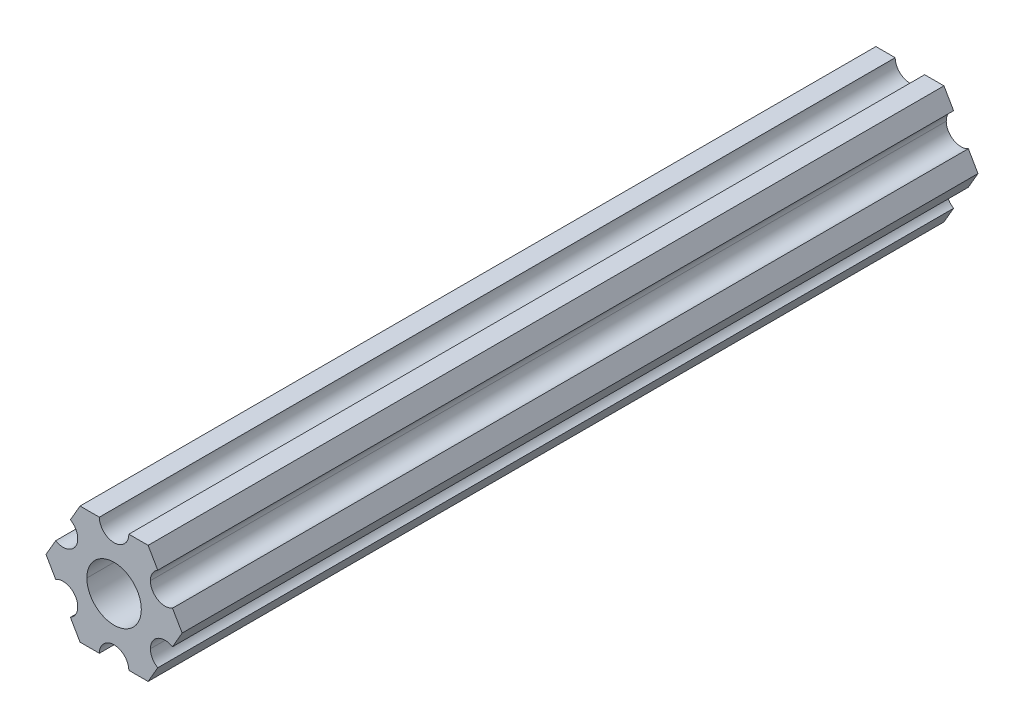
ISO-10303-21;
HEADER;
FILE_DESCRIPTION(('STEP AP214'),'2;1');
FILE_NAME('part.step','',(''),(''),'','','');
FILE_SCHEMA(('AUTOMOTIVE_DESIGN { 1 0 10303 214 1 1 1 1 }'));
ENDSEC;
DATA;
#1=APPLICATION_CONTEXT('core data for automotive mechanical design processes');
#2=APPLICATION_PROTOCOL_DEFINITION('international standard','automotive_design',2000,#1);
#3=PRODUCT_CONTEXT('',#1,'mechanical');
#4=PRODUCT('Part','Part','',(#3));
#5=PRODUCT_RELATED_PRODUCT_CATEGORY('part','',(#4));
#6=PRODUCT_DEFINITION_FORMATION('','',#4);
#7=PRODUCT_DEFINITION_CONTEXT('part definition',#1,'design');
#8=PRODUCT_DEFINITION('design','',#6,#7);
#9=PRODUCT_DEFINITION_SHAPE('','',#8);
#10=(LENGTH_UNIT() NAMED_UNIT(*) SI_UNIT(.MILLI.,.METRE.));
#11=(NAMED_UNIT(*) PLANE_ANGLE_UNIT() SI_UNIT($,.RADIAN.));
#12=(NAMED_UNIT(*) SI_UNIT($,.STERADIAN.) SOLID_ANGLE_UNIT());
#13=UNCERTAINTY_MEASURE_WITH_UNIT(LENGTH_MEASURE(1.E-05),#10,'distance_accuracy_value','');
#14=(GEOMETRIC_REPRESENTATION_CONTEXT(3) GLOBAL_UNCERTAINTY_ASSIGNED_CONTEXT((#13)) GLOBAL_UNIT_ASSIGNED_CONTEXT((#10,
#11,#12)) REPRESENTATION_CONTEXT('',''));
#15=CARTESIAN_POINT('',(0.,0.,0.));
#16=DIRECTION('',(0.,0.,1.));
#17=DIRECTION('',(1.,0.,0.));
#18=AXIS2_PLACEMENT_3D('',#15,#16,#17);
#19=CARTESIAN_POINT('',(0.,0.,85.725));
#20=DIRECTION('',(0.,0.,-1.));
#21=DIRECTION('',(-1.,0.,0.));
#22=AXIS2_PLACEMENT_3D('',#19,#20,#21);
#23=CYLINDRICAL_SURFACE('',#22,2.9337);
#24=DIRECTION('',(0.,0.,-1.));
#25=VECTOR('',#24,1.);
#26=CARTESIAN_POINT('',(2.9337,0.,85.725));
#27=LINE('',#26,#25);
#28=CARTESIAN_POINT('',(2.9337,0.,85.725));
#29=VERTEX_POINT('',#28);
#30=CARTESIAN_POINT('',(2.9337,0.,0.));
#31=VERTEX_POINT('',#30);
#32=EDGE_CURVE('E262',#29,#31,#27,.T.);
#33=ORIENTED_EDGE('',*,*,#32,.F.);
#34=CARTESIAN_POINT('',(0.,0.,85.725));
#35=DIRECTION('',(0.,0.,1.));
#36=DIRECTION('',(1.,0.,0.));
#37=AXIS2_PLACEMENT_3D('',#34,#35,#36);
#38=CIRCLE('',#37,2.9337);
#39=CARTESIAN_POINT('',(-2.9337,0.,85.725));
#40=VERTEX_POINT('',#39);
#41=EDGE_CURVE('E231',#29,#40,#38,.T.);
#42=ORIENTED_EDGE('',*,*,#41,.T.);
#43=DIRECTION('',(0.,0.,-1.));
#44=VECTOR('',#43,1.);
#45=CARTESIAN_POINT('',(-2.9337,0.,85.725));
#46=LINE('',#45,#44);
#47=CARTESIAN_POINT('',(-2.9337,0.,0.));
#48=VERTEX_POINT('',#47);
#49=EDGE_CURVE('E270',#40,#48,#46,.T.);
#50=ORIENTED_EDGE('',*,*,#49,.T.);
#51=CARTESIAN_POINT('',(0.,0.,0.));
#52=DIRECTION('',(0.,0.,1.));
#53=DIRECTION('',(1.,0.,0.));
#54=AXIS2_PLACEMENT_3D('',#51,#52,#53);
#55=CIRCLE('',#54,2.9337);
#56=EDGE_CURVE('E298',#31,#48,#55,.T.);
#57=ORIENTED_EDGE('',*,*,#56,.F.);
#58=EDGE_LOOP('',(#33,#42,#50,#57));
#59=FACE_BOUND('',#58,.T.);
#60=ADVANCED_FACE('F16',(#59),#23,.F.);
#61=CARTESIAN_POINT('',(5.49926150638082,-3.17499966684067,85.725));
#62=DIRECTION('',(0.,0.,-1.));
#63=DIRECTION('',(-1.,0.,0.));
#64=AXIS2_PLACEMENT_3D('',#61,#62,#63);
#65=CYLINDRICAL_SURFACE('',#64,1.5875);
#66=DIRECTION('',(0.,0.,-1.));
#67=VECTOR('',#66,1.);
#68=CARTESIAN_POINT('',(3.91176150638082,-3.17499966684067,85.725));
#69=LINE('',#68,#67);
#70=CARTESIAN_POINT('',(3.91176150638082,-3.17499966684067,85.725));
#71=VERTEX_POINT('',#70);
#72=CARTESIAN_POINT('',(3.91176150638082,-3.17499966684067,0.));
#73=VERTEX_POINT('',#72);
#74=EDGE_CURVE('E246',#71,#73,#69,.T.);
#75=ORIENTED_EDGE('',*,*,#74,.F.);
#76=CARTESIAN_POINT('',(5.49926150638082,-3.17499966684067,85.725));
#77=DIRECTION('',(0.,0.,-1.));
#78=DIRECTION('',(1.,0.,0.));
#79=AXIS2_PLACEMENT_3D('',#76,#77,#78);
#80=CIRCLE('',#79,1.5875);
#81=CARTESIAN_POINT('',(4.70551158967065,-4.54981504343587,85.725));
#82=VERTEX_POINT('',#81);
#83=EDGE_CURVE('E381',#82,#71,#80,.T.);
#84=ORIENTED_EDGE('',*,*,#83,.F.);
#85=DIRECTION('',(0.,0.,-1.));
#86=VECTOR('',#85,1.);
#87=CARTESIAN_POINT('',(4.70551158967065,-4.54981504343587,85.725));
#88=LINE('',#87,#86);
#89=CARTESIAN_POINT('',(4.70551158967065,-4.54981504343587,0.));
#90=VERTEX_POINT('',#89);
#91=EDGE_CURVE('E11',#82,#90,#88,.T.);
#92=ORIENTED_EDGE('',*,*,#91,.T.);
#93=CARTESIAN_POINT('',(5.49926150638082,-3.17499966684067,0.));
#94=DIRECTION('',(0.,0.,-1.));
#95=DIRECTION('',(1.,0.,0.));
#96=AXIS2_PLACEMENT_3D('',#93,#94,#95);
#97=CIRCLE('',#96,1.5875);
#98=EDGE_CURVE('E230',#90,#73,#97,.T.);
#99=ORIENTED_EDGE('',*,*,#98,.T.);
#100=EDGE_LOOP('',(#75,#84,#92,#99));
#101=FACE_BOUND('',#100,.T.);
#102=ADVANCED_FACE('F1023',(#101),#65,.F.);
#103=CARTESIAN_POINT('',(3.66617459405346,-6.34999977789375,85.725));
#104=DIRECTION('',(-0.86602543407573,0.499999947533941,0.));
#105=DIRECTION('',(0.,0.,1.));
#106=AXIS2_PLACEMENT_3D('',#103,#104,#105);
#107=PLANE('',#106);
#108=DIRECTION('',(0.499999947533941,0.86602543407573,0.));
#109=VECTOR('',#108,1.);
#110=CARTESIAN_POINT('',(3.66617459405346,-6.34999977789375,0.));
#111=LINE('',#110,#109);
#112=CARTESIAN_POINT('',(3.66617459405346,-6.34999977789375,0.));
#113=VERTEX_POINT('',#112);
#114=EDGE_CURVE('E390',#113,#90,#111,.T.);
#115=ORIENTED_EDGE('',*,*,#114,.T.);
#116=ORIENTED_EDGE('',*,*,#91,.F.);
#117=DIRECTION('',(0.499999947533941,0.86602543407573,0.));
#118=VECTOR('',#117,1.);
#119=CARTESIAN_POINT('',(3.66617459405346,-6.34999977789375,85.725));
#120=LINE('',#119,#118);
#121=CARTESIAN_POINT('',(3.66617459405346,-6.34999977789375,85.725));
#122=VERTEX_POINT('',#121);
#123=EDGE_CURVE('E377',#122,#82,#120,.T.);
#124=ORIENTED_EDGE('',*,*,#123,.F.);
#125=DIRECTION('',(0.,0.,-1.));
#126=VECTOR('',#125,1.);
#127=CARTESIAN_POINT('',(3.66617459405346,-6.34999977789375,85.725));
#128=LINE('',#127,#126);
#129=EDGE_CURVE('E24',#122,#113,#128,.T.);
#130=ORIENTED_EDGE('',*,*,#129,.T.);
#131=EDGE_LOOP('',(#115,#116,#124,#130));
#132=FACE_BOUND('',#131,.T.);
#133=ADVANCED_FACE('F1012',(#132),#107,.F.);
#134=CARTESIAN_POINT('',(1.58750038469926,-6.34999990382518,85.725));
#135=DIRECTION('',(-6.05825721258438E-08,1.,0.));
#136=DIRECTION('',(0.,0.,1.));
#137=AXIS2_PLACEMENT_3D('',#134,#135,#136);
#138=PLANE('',#137);
#139=DIRECTION('',(1.,6.05825721258438E-08,0.));
#140=VECTOR('',#139,1.);
#141=CARTESIAN_POINT('',(1.58750038469926,-6.34999990382518,0.));
#142=LINE('',#141,#140);
#143=CARTESIAN_POINT('',(1.58750038469926,-6.34999990382518,0.));
#144=VERTEX_POINT('',#143);
#145=EDGE_CURVE('E394',#144,#113,#142,.T.);
#146=ORIENTED_EDGE('',*,*,#145,.T.);
#147=ORIENTED_EDGE('',*,*,#129,.F.);
#148=DIRECTION('',(1.,6.05825721258438E-08,0.));
#149=VECTOR('',#148,1.);
#150=CARTESIAN_POINT('',(1.58750038469926,-6.34999990382518,85.725));
#151=LINE('',#150,#149);
#152=CARTESIAN_POINT('',(1.58750038469926,-6.34999990382518,85.725));
#153=VERTEX_POINT('',#152);
#154=EDGE_CURVE('E363',#153,#122,#151,.T.);
#155=ORIENTED_EDGE('',*,*,#154,.F.);
#156=DIRECTION('',(0.,0.,-1.));
#157=VECTOR('',#156,1.);
#158=CARTESIAN_POINT('',(1.58750038469926,-6.34999990382518,85.725));
#159=LINE('',#158,#157);
#160=EDGE_CURVE('E310',#153,#144,#159,.T.);
#161=ORIENTED_EDGE('',*,*,#160,.T.);
#162=EDGE_LOOP('',(#146,#147,#155,#161));
#163=FACE_BOUND('',#162,.T.);
#164=ADVANCED_FACE('F474',(#163),#138,.F.);
#165=CARTESIAN_POINT('',(3.8469926204343E-07,-6.35,85.725));
#166=DIRECTION('',(0.,0.,-1.));
#167=DIRECTION('',(-1.,0.,0.));
#168=AXIS2_PLACEMENT_3D('',#165,#166,#167);
#169=CYLINDRICAL_SURFACE('',#168,1.5875);
#170=CARTESIAN_POINT('',(3.8469926204343E-07,-6.35,0.));
#171=DIRECTION('',(0.,0.,-1.));
#172=DIRECTION('',(1.,0.,0.));
#173=AXIS2_PLACEMENT_3D('',#170,#171,#172);
#174=CIRCLE('',#173,1.5875);
#175=CARTESIAN_POINT('',(-1.58749961530073,-6.35000009617482,0.));
#176=VERTEX_POINT('',#175);
#177=EDGE_CURVE('E400',#176,#144,#174,.T.);
#178=ORIENTED_EDGE('',*,*,#177,.T.);
#179=ORIENTED_EDGE('',*,*,#160,.F.);
#180=CARTESIAN_POINT('',(3.8469926204343E-07,-6.35,85.725));
#181=DIRECTION('',(0.,0.,-1.));
#182=DIRECTION('',(1.,0.,0.));
#183=AXIS2_PLACEMENT_3D('',#180,#181,#182);
#184=CIRCLE('',#183,1.5875);
#185=CARTESIAN_POINT('',(-1.58749961530073,-6.35000009617482,85.725));
#186=VERTEX_POINT('',#185);
#187=EDGE_CURVE('E359',#186,#153,#184,.T.);
#188=ORIENTED_EDGE('',*,*,#187,.F.);
#189=DIRECTION('',(0.,0.,-1.));
#190=VECTOR('',#189,1.);
#191=CARTESIAN_POINT('',(-1.58749961530073,-6.35000009617482,85.725));
#192=LINE('',#191,#190);
#193=EDGE_CURVE('E313',#186,#176,#192,.T.);
#194=ORIENTED_EDGE('',*,*,#193,.T.);
#195=EDGE_LOOP('',(#178,#179,#188,#194));
#196=FACE_BOUND('',#195,.T.);
#197=ADVANCED_FACE('F464',(#196),#169,.F.);
#198=CARTESIAN_POINT('',(-3.66617382465481,-6.35000022210628,85.725));
#199=DIRECTION('',(-6.05825854783851E-08,1.,0.));
#200=DIRECTION('',(0.,0.,1.));
#201=AXIS2_PLACEMENT_3D('',#198,#199,#200);
#202=PLANE('',#201);
#203=DIRECTION('',(1.,6.05825854783851E-08,0.));
#204=VECTOR('',#203,1.);
#205=CARTESIAN_POINT('',(-3.66617382465481,-6.35000022210628,0.));
#206=LINE('',#205,#204);
#207=CARTESIAN_POINT('',(-3.66617382465481,-6.35000022210628,0.));
#208=VERTEX_POINT('',#207);
#209=EDGE_CURVE('E404',#208,#176,#206,.T.);
#210=ORIENTED_EDGE('',*,*,#209,.T.);
#211=ORIENTED_EDGE('',*,*,#193,.F.);
#212=DIRECTION('',(1.,6.05825854783851E-08,0.));
#213=VECTOR('',#212,1.);
#214=CARTESIAN_POINT('',(-3.66617382465481,-6.35000022210628,85.725));
#215=LINE('',#214,#213);
#216=CARTESIAN_POINT('',(-3.66617382465481,-6.35000022210628,85.725));
#217=VERTEX_POINT('',#216);
#218=EDGE_CURVE('E355',#217,#186,#215,.T.);
#219=ORIENTED_EDGE('',*,*,#218,.F.);
#220=DIRECTION('',(0.,0.,-1.));
#221=VECTOR('',#220,1.);
#222=CARTESIAN_POINT('',(-3.66617382465481,-6.35000022210628,85.725));
#223=LINE('',#222,#221);
#224=EDGE_CURVE('E326',#217,#208,#223,.T.);
#225=ORIENTED_EDGE('',*,*,#224,.T.);
#226=EDGE_LOOP('',(#210,#211,#219,#225));
#227=FACE_BOUND('',#226,.T.);
#228=ADVANCED_FACE('F470',(#227),#202,.F.);
#229=CARTESIAN_POINT('',(-4.70551103839172,-4.54981561357972,85.725));
#230=DIRECTION('',(0.866025373493152,0.500000052466045,0.));
#231=DIRECTION('',(0.,0.,-1.));
#232=AXIS2_PLACEMENT_3D('',#229,#230,#231);
#233=PLANE('',#232);
#234=DIRECTION('',(0.500000052466045,-0.866025373493152,0.));
#235=VECTOR('',#234,1.);
#236=CARTESIAN_POINT('',(-4.70551103839172,-4.54981561357972,0.));
#237=LINE('',#236,#235);
#238=CARTESIAN_POINT('',(-4.70551103839172,-4.54981561357972,0.));
#239=VERTEX_POINT('',#238);
#240=EDGE_CURVE('E373',#239,#208,#237,.T.);
#241=ORIENTED_EDGE('',*,*,#240,.T.);
#242=ORIENTED_EDGE('',*,*,#224,.F.);
#243=DIRECTION('',(0.500000052466045,-0.866025373493152,0.));
#244=VECTOR('',#243,1.);
#245=CARTESIAN_POINT('',(-4.70551103839172,-4.54981561357972,85.725));
#246=LINE('',#245,#244);
#247=CARTESIAN_POINT('',(-4.70551103839172,-4.54981561357972,85.725));
#248=VERTEX_POINT('',#247);
#249=EDGE_CURVE('E351',#248,#217,#246,.T.);
#250=ORIENTED_EDGE('',*,*,#249,.F.);
#251=DIRECTION('',(0.,0.,-1.));
#252=VECTOR('',#251,1.);
#253=CARTESIAN_POINT('',(-4.70551103839172,-4.54981561357972,85.725));
#254=LINE('',#253,#252);
#255=EDGE_CURVE('E323',#248,#239,#254,.T.);
#256=ORIENTED_EDGE('',*,*,#255,.T.);
#257=EDGE_LOOP('',(#241,#242,#250,#256));
#258=FACE_BOUND('',#257,.T.);
#259=ADVANCED_FACE('F482',(#258),#233,.F.);
#260=CARTESIAN_POINT('',(-5.49926112168156,-3.17500033315934,85.725));
#261=DIRECTION('',(0.,0.,-1.));
#262=DIRECTION('',(-1.,0.,0.));
#263=AXIS2_PLACEMENT_3D('',#260,#261,#262);
#264=CYLINDRICAL_SURFACE('',#263,1.5875);
#265=CARTESIAN_POINT('',(-5.49926112168156,-3.17500033315934,0.));
#266=DIRECTION('',(0.,0.,-1.));
#267=DIRECTION('',(1.,0.,0.));
#268=AXIS2_PLACEMENT_3D('',#265,#266,#267);
#269=CIRCLE('',#268,1.5875);
#270=CARTESIAN_POINT('',(-6.29301120497141,-1.80018505273897,0.));
#271=VERTEX_POINT('',#270);
#272=EDGE_CURVE('E369',#271,#239,#269,.T.);
#273=ORIENTED_EDGE('',*,*,#272,.T.);
#274=ORIENTED_EDGE('',*,*,#255,.F.);
#275=CARTESIAN_POINT('',(-5.49926112168156,-3.17500033315934,85.725));
#276=DIRECTION('',(0.,0.,-1.));
#277=DIRECTION('',(1.,0.,0.));
#278=AXIS2_PLACEMENT_3D('',#275,#276,#277);
#279=CIRCLE('',#278,1.5875);
#280=CARTESIAN_POINT('',(-6.29301120497141,-1.80018505273897,85.725));
#281=VERTEX_POINT('',#280);
#282=EDGE_CURVE('E347',#281,#248,#279,.T.);
#283=ORIENTED_EDGE('',*,*,#282,.F.);
#284=DIRECTION('',(0.,0.,-1.));
#285=VECTOR('',#284,1.);
#286=CARTESIAN_POINT('',(-6.29301120497141,-1.80018505273897,85.725));
#287=LINE('',#286,#285);
#288=EDGE_CURVE('E327',#281,#271,#287,.T.);
#289=ORIENTED_EDGE('',*,*,#288,.T.);
#290=EDGE_LOOP('',(#273,#274,#283,#289));
#291=FACE_BOUND('',#290,.T.);
#292=ADVANCED_FACE('F487',(#291),#264,.F.);
#293=CARTESIAN_POINT('',(-7.33234841870827,-4.44212523790841E-07,85.725));
#294=DIRECTION('',(0.866025373493151,0.500000052466045,0.));
#295=DIRECTION('',(0.,0.,-1.));
#296=AXIS2_PLACEMENT_3D('',#293,#294,#295);
#297=PLANE('',#296);
#298=DIRECTION('',(0.500000052466045,-0.866025373493151,0.));
#299=VECTOR('',#298,1.);
#300=CARTESIAN_POINT('',(-7.33234841870827,-4.44212523790841E-07,0.));
#301=LINE('',#300,#299);
#302=CARTESIAN_POINT('',(-7.33234841870827,-4.44212523790841E-07,0.));
#303=VERTEX_POINT('',#302);
#304=EDGE_CURVE('E364',#303,#271,#301,.T.);
#305=ORIENTED_EDGE('',*,*,#304,.T.);
#306=ORIENTED_EDGE('',*,*,#288,.F.);
#307=DIRECTION('',(0.500000052466045,-0.866025373493151,0.));
#308=VECTOR('',#307,1.);
#309=CARTESIAN_POINT('',(-7.33234841870827,-4.44212523790841E-07,85.725));
#310=LINE('',#309,#308);
#311=CARTESIAN_POINT('',(-7.33234841870827,-4.44212523790841E-07,85.725));
#312=VERTEX_POINT('',#311);
#313=EDGE_CURVE('E343',#312,#281,#310,.T.);
#314=ORIENTED_EDGE('',*,*,#313,.F.);
#315=DIRECTION('',(0.,0.,-1.));
#316=VECTOR('',#315,1.);
#317=CARTESIAN_POINT('',(-7.33234841870827,-4.44212523790841E-07,85.725));
#318=LINE('',#317,#316);
#319=EDGE_CURVE('E382',#312,#303,#318,.T.);
#320=ORIENTED_EDGE('',*,*,#319,.T.);
#321=EDGE_LOOP('',(#305,#306,#314,#320));
#322=FACE_BOUND('',#321,.T.);
#323=ADVANCED_FACE('F490',(#322),#297,.F.);
#324=CARTESIAN_POINT('',(-6.29301142309098,1.80018429024547,85.725));
#325=DIRECTION('',(0.866025434075724,-0.499999947533952,0.));
#326=DIRECTION('',(0.,0.,-1.));
#327=AXIS2_PLACEMENT_3D('',#324,#325,#326);
#328=PLANE('',#327);
#329=DIRECTION('',(-0.499999947533951,-0.866025434075724,0.));
#330=VECTOR('',#329,1.);
#331=CARTESIAN_POINT('',(-6.29301142309098,1.80018429024547,0.));
#332=LINE('',#331,#330);
#333=CARTESIAN_POINT('',(-6.29301142309098,1.80018429024547,0.));
#334=VERTEX_POINT('',#333);
#335=EDGE_CURVE('E368',#334,#303,#332,.T.);
#336=ORIENTED_EDGE('',*,*,#335,.T.);
#337=ORIENTED_EDGE('',*,*,#319,.F.);
#338=DIRECTION('',(-0.499999947533951,-0.866025434075724,0.));
#339=VECTOR('',#338,1.);
#340=CARTESIAN_POINT('',(-6.29301142309098,1.80018429024547,85.725));
#341=LINE('',#340,#339);
#342=CARTESIAN_POINT('',(-6.29301142309098,1.80018429024547,85.725));
#343=VERTEX_POINT('',#342);
#344=EDGE_CURVE('E295',#343,#312,#341,.T.);
#345=ORIENTED_EDGE('',*,*,#344,.F.);
#346=DIRECTION('',(0.,0.,-1.));
#347=VECTOR('',#346,1.);
#348=CARTESIAN_POINT('',(-6.29301142309098,1.80018429024547,85.725));
#349=LINE('',#348,#347);
#350=EDGE_CURVE('E385',#343,#334,#349,.T.);
#351=ORIENTED_EDGE('',*,*,#350,.T.);
#352=EDGE_LOOP('',(#336,#337,#345,#351));
#353=FACE_BOUND('',#352,.T.);
#354=ADVANCED_FACE('F493',(#353),#328,.F.);
#355=CARTESIAN_POINT('',(-5.49926150638082,3.17499966684067,85.725));
#356=DIRECTION('',(0.,0.,-1.));
#357=DIRECTION('',(-1.,0.,0.));
#358=AXIS2_PLACEMENT_3D('',#355,#356,#357);
#359=CYLINDRICAL_SURFACE('',#358,1.5875);
#360=CARTESIAN_POINT('',(-5.49926150638082,3.17499966684067,0.));
#361=DIRECTION('',(0.,0.,-1.));
#362=DIRECTION('',(1.,0.,0.));
#363=AXIS2_PLACEMENT_3D('',#360,#361,#362);
#364=CIRCLE('',#363,1.5875);
#365=CARTESIAN_POINT('',(-4.70551158967065,4.54981504343587,0.));
#366=VERTEX_POINT('',#365);
#367=EDGE_CURVE('E414',#366,#334,#364,.T.);
#368=ORIENTED_EDGE('',*,*,#367,.T.);
#369=ORIENTED_EDGE('',*,*,#350,.F.);
#370=CARTESIAN_POINT('',(-5.49926150638082,3.17499966684067,85.725));
#371=DIRECTION('',(0.,0.,-1.));
#372=DIRECTION('',(1.,0.,0.));
#373=AXIS2_PLACEMENT_3D('',#370,#371,#372);
#374=CIRCLE('',#373,1.5875);
#375=CARTESIAN_POINT('',(-4.70551158967065,4.54981504343587,85.725));
#376=VERTEX_POINT('',#375);
#377=EDGE_CURVE('E292',#376,#343,#374,.T.);
#378=ORIENTED_EDGE('',*,*,#377,.F.);
#379=DIRECTION('',(0.,0.,-1.));
#380=VECTOR('',#379,1.);
#381=CARTESIAN_POINT('',(-4.70551158967065,4.54981504343587,85.725));
#382=LINE('',#381,#380);
#383=EDGE_CURVE('E453',#376,#366,#382,.T.);
#384=ORIENTED_EDGE('',*,*,#383,.T.);
#385=EDGE_LOOP('',(#368,#369,#378,#384));
#386=FACE_BOUND('',#385,.T.);
#387=ADVANCED_FACE('F499',(#386),#359,.F.);
#388=CARTESIAN_POINT('',(-3.66617459405349,6.3499997778937,85.725));
#389=DIRECTION('',(0.866025434075729,-0.499999947533942,0.));
#390=DIRECTION('',(0.,0.,-1.));
#391=AXIS2_PLACEMENT_3D('',#388,#389,#390);
#392=PLANE('',#391);
#393=DIRECTION('',(-0.499999947533943,-0.866025434075729,0.));
#394=VECTOR('',#393,1.);
#395=CARTESIAN_POINT('',(-3.66617459405349,6.3499997778937,0.));
#396=LINE('',#395,#394);
#397=CARTESIAN_POINT('',(-3.66617459405349,6.3499997778937,0.));
#398=VERTEX_POINT('',#397);
#399=EDGE_CURVE('E418',#398,#366,#396,.T.);
#400=ORIENTED_EDGE('',*,*,#399,.T.);
#401=ORIENTED_EDGE('',*,*,#383,.F.);
#402=DIRECTION('',(-0.499999947533943,-0.866025434075729,0.));
#403=VECTOR('',#402,1.);
#404=CARTESIAN_POINT('',(-3.66617459405349,6.3499997778937,85.725));
#405=LINE('',#404,#403);
#406=CARTESIAN_POINT('',(-3.66617459405349,6.3499997778937,85.725));
#407=VERTEX_POINT('',#406);
#408=EDGE_CURVE('E296',#407,#376,#405,.T.);
#409=ORIENTED_EDGE('',*,*,#408,.F.);
#410=DIRECTION('',(0.,0.,-1.));
#411=VECTOR('',#410,1.);
#412=CARTESIAN_POINT('',(-3.66617459405349,6.3499997778937,85.725));
#413=LINE('',#412,#411);
#414=EDGE_CURVE('E450',#407,#398,#413,.T.);
#415=ORIENTED_EDGE('',*,*,#414,.T.);
#416=EDGE_LOOP('',(#400,#401,#409,#415));
#417=FACE_BOUND('',#416,.T.);
#418=ADVANCED_FACE('F503',(#417),#392,.F.);
#419=CARTESIAN_POINT('',(-1.58750038469926,6.34999990382518,85.725));
#420=DIRECTION('',(6.05825963273174E-08,-1.,0.));
#421=DIRECTION('',(0.,0.,-1.));
#422=AXIS2_PLACEMENT_3D('',#419,#420,#421);
#423=PLANE('',#422);
#424=DIRECTION('',(-1.,-6.05825963273174E-08,0.));
#425=VECTOR('',#424,1.);
#426=CARTESIAN_POINT('',(-1.58750038469926,6.34999990382518,0.));
#427=LINE('',#426,#425);
#428=CARTESIAN_POINT('',(-1.58750038469926,6.34999990382519,0.));
#429=VERTEX_POINT('',#428);
#430=EDGE_CURVE('E419',#429,#398,#427,.T.);
#431=ORIENTED_EDGE('',*,*,#430,.T.);
#432=ORIENTED_EDGE('',*,*,#414,.F.);
#433=DIRECTION('',(-1.,-6.05825963273174E-08,0.));
#434=VECTOR('',#433,1.);
#435=CARTESIAN_POINT('',(-1.58750038469926,6.34999990382518,85.725));
#436=LINE('',#435,#434);
#437=CARTESIAN_POINT('',(-1.58750038469926,6.34999990382519,85.725));
#438=VERTEX_POINT('',#437);
#439=EDGE_CURVE('E331',#438,#407,#436,.T.);
#440=ORIENTED_EDGE('',*,*,#439,.F.);
#441=DIRECTION('',(0.,0.,-1.));
#442=VECTOR('',#441,1.);
#443=CARTESIAN_POINT('',(-1.58750038469926,6.34999990382519,85.725));
#444=LINE('',#443,#442);
#445=EDGE_CURVE('E447',#438,#429,#444,.T.);
#446=ORIENTED_EDGE('',*,*,#445,.T.);
#447=EDGE_LOOP('',(#431,#432,#440,#446));
#448=FACE_BOUND('',#447,.T.);
#449=ADVANCED_FACE('F913',(#448),#423,.F.);
#450=CARTESIAN_POINT('',(-3.84699260060323E-07,6.35,85.725));
#451=DIRECTION('',(0.,0.,-1.));
#452=DIRECTION('',(-1.,0.,0.));
#453=AXIS2_PLACEMENT_3D('',#450,#451,#452);
#454=CYLINDRICAL_SURFACE('',#453,1.5875);
#455=CARTESIAN_POINT('',(-3.84699260060323E-07,6.35,0.));
#456=DIRECTION('',(0.,0.,-1.));
#457=DIRECTION('',(1.,0.,0.));
#458=AXIS2_PLACEMENT_3D('',#455,#456,#457);
#459=CIRCLE('',#458,1.5875);
#460=CARTESIAN_POINT('',(1.58749961530074,6.35000009617482,0.));
#461=VERTEX_POINT('',#460);
#462=EDGE_CURVE('E423',#461,#429,#459,.T.);
#463=ORIENTED_EDGE('',*,*,#462,.T.);
#464=ORIENTED_EDGE('',*,*,#445,.F.);
#465=CARTESIAN_POINT('',(-3.84699260060323E-07,6.35,85.725));
#466=DIRECTION('',(0.,0.,-1.));
#467=DIRECTION('',(1.,0.,0.));
#468=AXIS2_PLACEMENT_3D('',#465,#466,#467);
#469=CIRCLE('',#468,1.5875);
#470=CARTESIAN_POINT('',(1.58749961530074,6.35000009617482,85.725));
#471=VERTEX_POINT('',#470);
#472=EDGE_CURVE('E322',#471,#438,#469,.T.);
#473=ORIENTED_EDGE('',*,*,#472,.F.);
#474=DIRECTION('',(0.,0.,-1.));
#475=VECTOR('',#474,1.);
#476=CARTESIAN_POINT('',(1.58749961530074,6.35000009617482,85.725));
#477=LINE('',#476,#475);
#478=EDGE_CURVE('E444',#471,#461,#477,.T.);
#479=ORIENTED_EDGE('',*,*,#478,.T.);
#480=EDGE_LOOP('',(#463,#464,#473,#479));
#481=FACE_BOUND('',#480,.T.);
#482=ADVANCED_FACE('F901',(#481),#454,.F.);
#483=CARTESIAN_POINT('',(3.66617382465481,6.35000022210627,85.725));
#484=DIRECTION('',(6.05825850611185E-08,-1.,0.));
#485=DIRECTION('',(0.,0.,-1.));
#486=AXIS2_PLACEMENT_3D('',#483,#484,#485);
#487=PLANE('',#486);
#488=DIRECTION('',(-1.,-6.05825850611185E-08,0.));
#489=VECTOR('',#488,1.);
#490=CARTESIAN_POINT('',(3.66617382465481,6.35000022210627,0.));
#491=LINE('',#490,#489);
#492=CARTESIAN_POINT('',(3.66617382465481,6.35000022210627,0.));
#493=VERTEX_POINT('',#492);
#494=EDGE_CURVE('E429',#493,#461,#491,.T.);
#495=ORIENTED_EDGE('',*,*,#494,.T.);
#496=ORIENTED_EDGE('',*,*,#478,.F.);
#497=DIRECTION('',(-1.,-6.05825850611185E-08,0.));
#498=VECTOR('',#497,1.);
#499=CARTESIAN_POINT('',(3.66617382465481,6.35000022210627,85.725));
#500=LINE('',#499,#498);
#501=CARTESIAN_POINT('',(3.66617382465481,6.35000022210627,85.725));
#502=VERTEX_POINT('',#501);
#503=EDGE_CURVE('E309',#502,#471,#500,.T.);
#504=ORIENTED_EDGE('',*,*,#503,.F.);
#505=DIRECTION('',(0.,0.,-1.));
#506=VECTOR('',#505,1.);
#507=CARTESIAN_POINT('',(3.66617382465481,6.35000022210627,85.725));
#508=LINE('',#507,#506);
#509=EDGE_CURVE('E48',#502,#493,#508,.T.);
#510=ORIENTED_EDGE('',*,*,#509,.T.);
#511=EDGE_LOOP('',(#495,#496,#504,#510));
#512=FACE_BOUND('',#511,.T.);
#513=ADVANCED_FACE('F888',(#512),#487,.F.);
#514=CARTESIAN_POINT('',(4.70551103839172,4.54981561357972,85.725));
#515=DIRECTION('',(-0.866025373493151,-0.500000052466046,0.));
#516=DIRECTION('',(-0.500000052466046,0.866025373493151,0.));
#517=AXIS2_PLACEMENT_3D('',#514,#515,#516);
#518=PLANE('',#517);
#519=DIRECTION('',(-0.500000052466046,0.866025373493151,0.));
#520=VECTOR('',#519,1.);
#521=CARTESIAN_POINT('',(4.70551103839172,4.54981561357972,0.));
#522=LINE('',#521,#520);
#523=CARTESIAN_POINT('',(4.70551103839172,4.54981561357972,0.));
#524=VERTEX_POINT('',#523);
#525=EDGE_CURVE('E432',#524,#493,#522,.T.);
#526=ORIENTED_EDGE('',*,*,#525,.T.);
#527=ORIENTED_EDGE('',*,*,#509,.F.);
#528=DIRECTION('',(-0.500000052466046,0.866025373493151,0.));
#529=VECTOR('',#528,1.);
#530=CARTESIAN_POINT('',(4.70551103839172,4.54981561357972,85.725));
#531=LINE('',#530,#529);
#532=CARTESIAN_POINT('',(4.70551103839172,4.54981561357972,85.725));
#533=VERTEX_POINT('',#532);
#534=EDGE_CURVE('E305',#533,#502,#531,.T.);
#535=ORIENTED_EDGE('',*,*,#534,.F.);
#536=DIRECTION('',(0.,0.,-1.));
#537=VECTOR('',#536,1.);
#538=CARTESIAN_POINT('',(4.70551103839172,4.54981561357972,85.725));
#539=LINE('',#538,#537);
#540=EDGE_CURVE('E271',#533,#524,#539,.T.);
#541=ORIENTED_EDGE('',*,*,#540,.T.);
#542=EDGE_LOOP('',(#526,#527,#535,#541));
#543=FACE_BOUND('',#542,.T.);
#544=ADVANCED_FACE('F877',(#543),#518,.F.);
#545=CARTESIAN_POINT('',(5.49926112168156,3.17500033315934,85.725));
#546=DIRECTION('',(0.,0.,-1.));
#547=DIRECTION('',(-1.,0.,0.));
#548=AXIS2_PLACEMENT_3D('',#545,#546,#547);
#549=CYLINDRICAL_SURFACE('',#548,1.5875);
#550=DIRECTION('',(0.,0.,-1.));
#551=VECTOR('',#550,1.);
#552=CARTESIAN_POINT('',(3.91176112168156,3.17500033315934,85.725));
#553=LINE('',#552,#551);
#554=CARTESIAN_POINT('',(3.91176112168156,3.17500033315934,85.725));
#555=VERTEX_POINT('',#554);
#556=CARTESIAN_POINT('',(3.91176112168156,3.17500033315934,0.));
#557=VERTEX_POINT('',#556);
#558=EDGE_CURVE('E276',#555,#557,#553,.T.);
#559=ORIENTED_EDGE('',*,*,#558,.F.);
#560=CARTESIAN_POINT('',(5.49926112168156,3.17500033315934,85.725));
#561=DIRECTION('',(0.,0.,-1.));
#562=DIRECTION('',(1.,0.,0.));
#563=AXIS2_PLACEMENT_3D('',#560,#561,#562);
#564=CIRCLE('',#563,1.5875);
#565=CARTESIAN_POINT('',(6.29301120497139,1.80018505273894,85.725));
#566=VERTEX_POINT('',#565);
#567=EDGE_CURVE('E287',#566,#555,#564,.T.);
#568=ORIENTED_EDGE('',*,*,#567,.F.);
#569=DIRECTION('',(0.,0.,-1.));
#570=VECTOR('',#569,1.);
#571=CARTESIAN_POINT('',(6.29301120497139,1.80018505273894,85.725));
#572=LINE('',#571,#570);
#573=CARTESIAN_POINT('',(6.29301120497139,1.80018505273894,0.));
#574=VERTEX_POINT('',#573);
#575=EDGE_CURVE('E37',#566,#574,#572,.T.);
#576=ORIENTED_EDGE('',*,*,#575,.T.);
#577=CARTESIAN_POINT('',(5.49926112168156,3.17500033315934,0.));
#578=DIRECTION('',(0.,0.,-1.));
#579=DIRECTION('',(1.,0.,0.));
#580=AXIS2_PLACEMENT_3D('',#577,#578,#579);
#581=CIRCLE('',#580,1.5875);
#582=EDGE_CURVE('E435',#574,#557,#581,.T.);
#583=ORIENTED_EDGE('',*,*,#582,.T.);
#584=EDGE_LOOP('',(#559,#568,#576,#583));
#585=FACE_BOUND('',#584,.T.);
#586=ADVANCED_FACE('F864',(#585),#549,.F.);
#587=CARTESIAN_POINT('',(7.33234841870827,4.44212519169686E-07,85.725));
#588=DIRECTION('',(-0.866025373493145,-0.500000052466057,0.));
#589=DIRECTION('',(-0.500000052466057,0.866025373493145,0.));
#590=AXIS2_PLACEMENT_3D('',#587,#588,#589);
#591=PLANE('',#590);
#592=DIRECTION('',(-0.500000052466057,0.866025373493145,0.));
#593=VECTOR('',#592,1.);
#594=CARTESIAN_POINT('',(7.33234841870827,4.44212519169686E-07,0.));
#595=LINE('',#594,#593);
#596=CARTESIAN_POINT('',(7.33234841870827,4.44212519169686E-07,0.));
#597=VERTEX_POINT('',#596);
#598=EDGE_CURVE('E227',#597,#574,#595,.T.);
#599=ORIENTED_EDGE('',*,*,#598,.T.);
#600=ORIENTED_EDGE('',*,*,#575,.F.);
#601=DIRECTION('',(-0.500000052466057,0.866025373493145,0.));
#602=VECTOR('',#601,1.);
#603=CARTESIAN_POINT('',(7.33234841870827,4.44212519169686E-07,85.725));
#604=LINE('',#603,#602);
#605=CARTESIAN_POINT('',(7.33234841870827,4.44212519169686E-07,85.725));
#606=VERTEX_POINT('',#605);
#607=EDGE_CURVE('E283',#606,#566,#604,.T.);
#608=ORIENTED_EDGE('',*,*,#607,.F.);
#609=DIRECTION('',(0.,0.,-1.));
#610=VECTOR('',#609,1.);
#611=CARTESIAN_POINT('',(7.33234841870827,4.44212519169686E-07,85.725));
#612=LINE('',#611,#610);
#613=EDGE_CURVE('E300',#606,#597,#612,.T.);
#614=ORIENTED_EDGE('',*,*,#613,.T.);
#615=EDGE_LOOP('',(#599,#600,#608,#614));
#616=FACE_BOUND('',#615,.T.);
#617=ADVANCED_FACE('F853',(#616),#591,.F.);
#618=CARTESIAN_POINT('',(6.29301142309098,-1.80018429024546,85.725));
#619=DIRECTION('',(-0.866025434075723,0.499999947533953,0.));
#620=DIRECTION('',(0.,0.,1.));
#621=AXIS2_PLACEMENT_3D('',#618,#619,#620);
#622=PLANE('',#621);
#623=DIRECTION('',(0.499999947533953,0.866025434075723,0.));
#624=VECTOR('',#623,1.);
#625=CARTESIAN_POINT('',(6.29301142309098,-1.80018429024546,0.));
#626=LINE('',#625,#624);
#627=CARTESIAN_POINT('',(6.29301142309098,-1.80018429024546,0.));
#628=VERTEX_POINT('',#627);
#629=EDGE_CURVE('E219',#628,#597,#626,.T.);
#630=ORIENTED_EDGE('',*,*,#629,.T.);
#631=ORIENTED_EDGE('',*,*,#613,.F.);
#632=DIRECTION('',(0.499999947533953,0.866025434075723,0.));
#633=VECTOR('',#632,1.);
#634=CARTESIAN_POINT('',(6.29301142309098,-1.80018429024546,85.725));
#635=LINE('',#634,#633);
#636=CARTESIAN_POINT('',(6.29301142309098,-1.80018429024546,85.725));
#637=VERTEX_POINT('',#636);
#638=EDGE_CURVE('E237',#637,#606,#635,.T.);
#639=ORIENTED_EDGE('',*,*,#638,.F.);
#640=DIRECTION('',(0.,0.,-1.));
#641=VECTOR('',#640,1.);
#642=CARTESIAN_POINT('',(6.29301142309098,-1.80018429024546,85.725));
#643=LINE('',#642,#641);
#644=EDGE_CURVE('E234',#637,#628,#643,.T.);
#645=ORIENTED_EDGE('',*,*,#644,.T.);
#646=EDGE_LOOP('',(#630,#631,#639,#645));
#647=FACE_BOUND('',#646,.T.);
#648=ADVANCED_FACE('F235',(#647),#622,.F.);
#649=CARTESIAN_POINT('',(5.49926112168156,3.17500033315934,0.));
#650=DIRECTION('',(0.,0.,1.));
#651=DIRECTION('',(1.,0.,0.));
#652=AXIS2_PLACEMENT_3D('',#649,#650,#651);
#653=PLANE('',#652);
#654=CARTESIAN_POINT('',(0.,0.,0.));
#655=DIRECTION('',(0.,0.,1.));
#656=DIRECTION('',(1.,0.,0.));
#657=AXIS2_PLACEMENT_3D('',#654,#655,#656);
#658=CIRCLE('',#657,2.9337);
#659=EDGE_CURVE('E266',#48,#31,#658,.T.);
#660=ORIENTED_EDGE('',*,*,#659,.T.);
#661=ORIENTED_EDGE('',*,*,#56,.T.);
#662=EDGE_LOOP('',(#660,#661));
#663=FACE_BOUND('',#662,.T.);
#664=ORIENTED_EDGE('',*,*,#629,.F.);
#665=CARTESIAN_POINT('',(5.49926150638082,-3.17499966684067,0.));
#666=DIRECTION('',(0.,0.,-1.));
#667=DIRECTION('',(1.,0.,0.));
#668=AXIS2_PLACEMENT_3D('',#665,#666,#667);
#669=CIRCLE('',#668,1.5875);
#670=EDGE_CURVE('E224',#73,#628,#669,.T.);
#671=ORIENTED_EDGE('',*,*,#670,.F.);
#672=ORIENTED_EDGE('',*,*,#98,.F.);
#673=ORIENTED_EDGE('',*,*,#114,.F.);
#674=ORIENTED_EDGE('',*,*,#145,.F.);
#675=ORIENTED_EDGE('',*,*,#177,.F.);
#676=ORIENTED_EDGE('',*,*,#209,.F.);
#677=ORIENTED_EDGE('',*,*,#240,.F.);
#678=ORIENTED_EDGE('',*,*,#272,.F.);
#679=ORIENTED_EDGE('',*,*,#304,.F.);
#680=ORIENTED_EDGE('',*,*,#335,.F.);
#681=ORIENTED_EDGE('',*,*,#367,.F.);
#682=ORIENTED_EDGE('',*,*,#399,.F.);
#683=ORIENTED_EDGE('',*,*,#430,.F.);
#684=ORIENTED_EDGE('',*,*,#462,.F.);
#685=ORIENTED_EDGE('',*,*,#494,.F.);
#686=ORIENTED_EDGE('',*,*,#525,.F.);
#687=CARTESIAN_POINT('',(5.49926112168156,3.17500033315934,0.));
#688=DIRECTION('',(0.,0.,-1.));
#689=DIRECTION('',(1.,0.,0.));
#690=AXIS2_PLACEMENT_3D('',#687,#688,#689);
#691=CIRCLE('',#690,1.5875);
#692=EDGE_CURVE('E275',#557,#524,#691,.T.);
#693=ORIENTED_EDGE('',*,*,#692,.F.);
#694=ORIENTED_EDGE('',*,*,#582,.F.);
#695=ORIENTED_EDGE('',*,*,#598,.F.);
#696=EDGE_LOOP('',(#664,#671,#672,#673,#674,#675,#676,#677,#678,#679,#680,#681,#682,#683,#684,
#685,#686,#693,#694,#695));
#697=FACE_BOUND('',#696,.T.);
#698=ADVANCED_FACE('F221',(#663,#697),#653,.F.);
#699=CARTESIAN_POINT('',(5.49926112168156,3.17500033315934,85.725));
#700=DIRECTION('',(0.,0.,1.));
#701=DIRECTION('',(1.,0.,0.));
#702=AXIS2_PLACEMENT_3D('',#699,#700,#701);
#703=PLANE('',#702);
#704=CARTESIAN_POINT('',(0.,0.,85.725));
#705=DIRECTION('',(0.,0.,1.));
#706=DIRECTION('',(1.,0.,0.));
#707=AXIS2_PLACEMENT_3D('',#704,#705,#706);
#708=CIRCLE('',#707,2.9337);
#709=EDGE_CURVE('E258',#40,#29,#708,.T.);
#710=ORIENTED_EDGE('',*,*,#709,.F.);
#711=ORIENTED_EDGE('',*,*,#41,.F.);
#712=EDGE_LOOP('',(#710,#711));
#713=FACE_BOUND('',#712,.T.);
#714=ORIENTED_EDGE('',*,*,#638,.T.);
#715=ORIENTED_EDGE('',*,*,#607,.T.);
#716=ORIENTED_EDGE('',*,*,#567,.T.);
#717=CARTESIAN_POINT('',(5.49926112168156,3.17500033315934,85.725));
#718=DIRECTION('',(0.,0.,-1.));
#719=DIRECTION('',(1.,0.,0.));
#720=AXIS2_PLACEMENT_3D('',#717,#718,#719);
#721=CIRCLE('',#720,1.5875);
#722=EDGE_CURVE('E242',#555,#533,#721,.T.);
#723=ORIENTED_EDGE('',*,*,#722,.T.);
#724=ORIENTED_EDGE('',*,*,#534,.T.);
#725=ORIENTED_EDGE('',*,*,#503,.T.);
#726=ORIENTED_EDGE('',*,*,#472,.T.);
#727=ORIENTED_EDGE('',*,*,#439,.T.);
#728=ORIENTED_EDGE('',*,*,#408,.T.);
#729=ORIENTED_EDGE('',*,*,#377,.T.);
#730=ORIENTED_EDGE('',*,*,#344,.T.);
#731=ORIENTED_EDGE('',*,*,#313,.T.);
#732=ORIENTED_EDGE('',*,*,#282,.T.);
#733=ORIENTED_EDGE('',*,*,#249,.T.);
#734=ORIENTED_EDGE('',*,*,#218,.T.);
#735=ORIENTED_EDGE('',*,*,#187,.T.);
#736=ORIENTED_EDGE('',*,*,#154,.T.);
#737=ORIENTED_EDGE('',*,*,#123,.T.);
#738=ORIENTED_EDGE('',*,*,#83,.T.);
#739=CARTESIAN_POINT('',(5.49926150638082,-3.17499966684067,85.725));
#740=DIRECTION('',(0.,0.,-1.));
#741=DIRECTION('',(1.,0.,0.));
#742=AXIS2_PLACEMENT_3D('',#739,#740,#741);
#743=CIRCLE('',#742,1.5875);
#744=EDGE_CURVE('E253',#71,#637,#743,.T.);
#745=ORIENTED_EDGE('',*,*,#744,.T.);
#746=EDGE_LOOP('',(#714,#715,#716,#723,#724,#725,#726,#727,#728,#729,#730,#731,#732,#733,#734,
#735,#736,#737,#738,#745));
#747=FACE_BOUND('',#746,.T.);
#748=ADVANCED_FACE('F478',(#713,#747),#703,.T.);
#749=CARTESIAN_POINT('',(5.49926112168156,3.17500033315934,85.725));
#750=DIRECTION('',(0.,0.,-1.));
#751=DIRECTION('',(-1.,0.,0.));
#752=AXIS2_PLACEMENT_3D('',#749,#750,#751);
#753=CYLINDRICAL_SURFACE('',#752,1.5875);
#754=ORIENTED_EDGE('',*,*,#722,.F.);
#755=ORIENTED_EDGE('',*,*,#558,.T.);
#756=ORIENTED_EDGE('',*,*,#692,.T.);
#757=ORIENTED_EDGE('',*,*,#540,.F.);
#758=EDGE_LOOP('',(#754,#755,#756,#757));
#759=FACE_BOUND('',#758,.T.);
#760=ADVANCED_FACE('F810',(#759),#753,.F.);
#761=CARTESIAN_POINT('',(5.49926150638082,-3.17499966684067,85.725));
#762=DIRECTION('',(0.,0.,-1.));
#763=DIRECTION('',(-1.,0.,0.));
#764=AXIS2_PLACEMENT_3D('',#761,#762,#763);
#765=CYLINDRICAL_SURFACE('',#764,1.5875);
#766=ORIENTED_EDGE('',*,*,#744,.F.);
#767=ORIENTED_EDGE('',*,*,#74,.T.);
#768=ORIENTED_EDGE('',*,*,#670,.T.);
#769=ORIENTED_EDGE('',*,*,#644,.F.);
#770=EDGE_LOOP('',(#766,#767,#768,#769));
#771=FACE_BOUND('',#770,.T.);
#772=ADVANCED_FACE('F244',(#771),#765,.F.);
#773=CARTESIAN_POINT('',(0.,0.,85.725));
#774=DIRECTION('',(0.,0.,-1.));
#775=DIRECTION('',(-1.,0.,0.));
#776=AXIS2_PLACEMENT_3D('',#773,#774,#775);
#777=CYLINDRICAL_SURFACE('',#776,2.9337);
#778=ORIENTED_EDGE('',*,*,#709,.T.);
#779=ORIENTED_EDGE('',*,*,#32,.T.);
#780=ORIENTED_EDGE('',*,*,#659,.F.);
#781=ORIENTED_EDGE('',*,*,#49,.F.);
#782=EDGE_LOOP('',(#778,#779,#780,#781));
#783=FACE_BOUND('',#782,.T.);
#784=ADVANCED_FACE('F791',(#783),#777,.F.);
#785=CLOSED_SHELL('',(#60,#102,#133,#164,#197,#228,#259,#292,#323,#354,#387,#418,#449,#482,#513,
#544,#586,#617,#648,#698,#748,#760,#772,#784));
#786=MANIFOLD_SOLID_BREP('B1',#785);
#787=ADVANCED_BREP_SHAPE_REPRESENTATION('',(#18,#786),#14);
#788=SHAPE_DEFINITION_REPRESENTATION(#9,#787);
ENDSEC;
END-ISO-10303-21;
